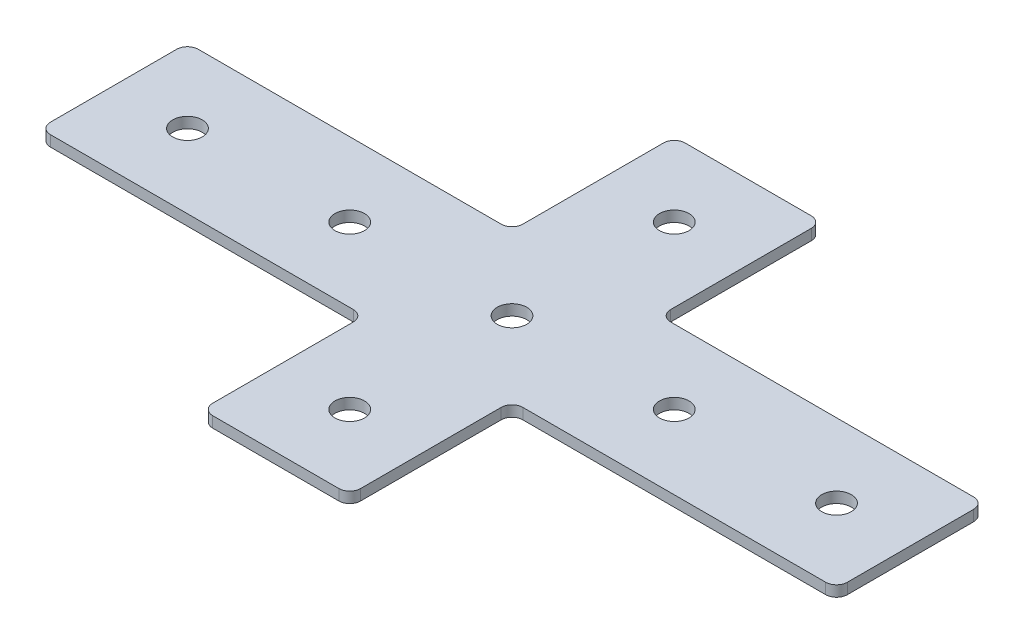
ISO-10303-21;
HEADER;
FILE_DESCRIPTION(('STEP AP214'),'2;1');
FILE_NAME('part.step','',(''),(''),'','','');
FILE_SCHEMA(('AUTOMOTIVE_DESIGN { 1 0 10303 214 1 1 1 1 }'));
ENDSEC;
DATA;
#1=APPLICATION_CONTEXT('core data for automotive mechanical design processes');
#2=APPLICATION_PROTOCOL_DEFINITION('international standard','automotive_design',2000,#1);
#3=PRODUCT_CONTEXT('',#1,'mechanical');
#4=PRODUCT('Part','Part','',(#3));
#5=PRODUCT_RELATED_PRODUCT_CATEGORY('part','',(#4));
#6=PRODUCT_DEFINITION_FORMATION('','',#4);
#7=PRODUCT_DEFINITION_CONTEXT('part definition',#1,'design');
#8=PRODUCT_DEFINITION('design','',#6,#7);
#9=PRODUCT_DEFINITION_SHAPE('','',#8);
#10=(LENGTH_UNIT() NAMED_UNIT(*) SI_UNIT(.MILLI.,.METRE.));
#11=(NAMED_UNIT(*) PLANE_ANGLE_UNIT() SI_UNIT($,.RADIAN.));
#12=(NAMED_UNIT(*) SI_UNIT($,.STERADIAN.) SOLID_ANGLE_UNIT());
#13=UNCERTAINTY_MEASURE_WITH_UNIT(LENGTH_MEASURE(1.E-05),#10,'distance_accuracy_value','');
#14=(GEOMETRIC_REPRESENTATION_CONTEXT(3) GLOBAL_UNCERTAINTY_ASSIGNED_CONTEXT((#13)) GLOBAL_UNIT_ASSIGNED_CONTEXT((#10,
#11,#12)) REPRESENTATION_CONTEXT('',''));
#15=CARTESIAN_POINT('',(0.,0.,0.));
#16=DIRECTION('',(0.,0.,1.));
#17=DIRECTION('',(1.,0.,0.));
#18=AXIS2_PLACEMENT_3D('',#15,#16,#17);
#19=CARTESIAN_POINT('',(-1.42451364331464,0.774709326684388,-0.849826009471144));
#20=DIRECTION('',(0.,-1.,0.));
#21=DIRECTION('',(0.,0.,-1.));
#22=AXIS2_PLACEMENT_3D('',#19,#20,#21);
#23=PLANE('',#22);
#24=CARTESIAN_POINT('',(-46.4245136433146,0.774709326684388,-0.849826009471123));
#25=DIRECTION('',(0.,-1.,0.));
#26=DIRECTION('',(0.,0.,1.));
#27=AXIS2_PLACEMENT_3D('',#24,#25,#26);
#28=CIRCLE('',#27,4.1);
#29=CARTESIAN_POINT('',(-46.4245136433146,0.774709326684388,3.25017399052888));
#30=VERTEX_POINT('',#29);
#31=EDGE_CURVE('E188',#30,#30,#28,.T.);
#32=ORIENTED_EDGE('',*,*,#31,.F.);
#33=EDGE_LOOP('',(#32));
#34=FACE_BOUND('',#33,.T.);
#35=CARTESIAN_POINT('',(-91.4245136433146,0.774709326684388,-0.849826009471122));
#36=DIRECTION('',(0.,-1.,0.));
#37=DIRECTION('',(0.,0.,1.));
#38=AXIS2_PLACEMENT_3D('',#35,#36,#37);
#39=CIRCLE('',#38,4.09999999999999);
#40=CARTESIAN_POINT('',(-91.4245136433146,0.774709326684388,3.25017399052886));
#41=VERTEX_POINT('',#40);
#42=EDGE_CURVE('E289',#41,#41,#39,.T.);
#43=ORIENTED_EDGE('',*,*,#42,.F.);
#44=EDGE_LOOP('',(#43));
#45=FACE_BOUND('',#44,.T.);
#46=CARTESIAN_POINT('',(-1.42451364331464,0.774709326684388,-0.849826009471144));
#47=DIRECTION('',(0.,1.,0.));
#48=DIRECTION('',(0.,0.,1.));
#49=AXIS2_PLACEMENT_3D('',#46,#47,#48);
#50=CIRCLE('',#49,4.1);
#51=CARTESIAN_POINT('',(-1.42451364331464,0.774709326684388,3.25017399052886));
#52=VERTEX_POINT('',#51);
#53=EDGE_CURVE('E360',#52,#52,#50,.T.);
#54=ORIENTED_EDGE('',*,*,#53,.T.);
#55=EDGE_LOOP('',(#54));
#56=FACE_BOUND('',#55,.T.);
#57=CARTESIAN_POINT('',(106.075486356685,0.774709326684388,-18.3498260094712));
#58=DIRECTION('',(0.,1.,0.));
#59=DIRECTION('',(0.,0.,1.));
#60=AXIS2_PLACEMENT_3D('',#57,#58,#59);
#61=CIRCLE('',#60,3.);
#62=CARTESIAN_POINT('',(109.075486356685,0.774709326684388,-18.3498260094712));
#63=VERTEX_POINT('',#62);
#64=CARTESIAN_POINT('',(106.075486356685,0.774709326684388,-21.3498260094712));
#65=VERTEX_POINT('',#64);
#66=EDGE_CURVE('E265',#63,#65,#61,.T.);
#67=ORIENTED_EDGE('',*,*,#66,.F.);
#68=DIRECTION('',(0.,0.,-1.));
#69=VECTOR('',#68,1.);
#70=CARTESIAN_POINT('',(109.075486356685,0.774709326684388,19.6501739905289));
#71=LINE('',#70,#69);
#72=CARTESIAN_POINT('',(109.075486356685,0.774709326684388,16.6501739905289));
#73=VERTEX_POINT('',#72);
#74=EDGE_CURVE('E366',#73,#63,#71,.T.);
#75=ORIENTED_EDGE('',*,*,#74,.F.);
#76=CARTESIAN_POINT('',(106.075486356685,0.774709326684388,16.6501739905289));
#77=DIRECTION('',(0.,-1.,0.));
#78=DIRECTION('',(0.,0.,-1.));
#79=AXIS2_PLACEMENT_3D('',#76,#77,#78);
#80=CIRCLE('',#79,3.);
#81=CARTESIAN_POINT('',(106.075486356685,0.774709326684388,19.6501739905289));
#82=VERTEX_POINT('',#81);
#83=EDGE_CURVE('E391',#73,#82,#80,.T.);
#84=ORIENTED_EDGE('',*,*,#83,.T.);
#85=DIRECTION('',(1.,0.,0.));
#86=VECTOR('',#85,1.);
#87=CARTESIAN_POINT('',(19.0754863566853,0.774709326684388,19.6501739905289));
#88=LINE('',#87,#86);
#89=CARTESIAN_POINT('',(22.0754863566853,0.774709326684388,19.6501739905289));
#90=VERTEX_POINT('',#89);
#91=EDGE_CURVE('E373',#90,#82,#88,.T.);
#92=ORIENTED_EDGE('',*,*,#91,.F.);
#93=CARTESIAN_POINT('',(22.0754863566853,0.774709326684388,22.6501739905289));
#94=DIRECTION('',(0.,-1.,0.));
#95=DIRECTION('',(0.,0.,-1.));
#96=AXIS2_PLACEMENT_3D('',#93,#94,#95);
#97=CIRCLE('',#96,3.);
#98=CARTESIAN_POINT('',(19.0754863566853,0.774709326684388,22.6501739905289));
#99=VERTEX_POINT('',#98);
#100=EDGE_CURVE('E10',#90,#99,#97,.F.);
#101=ORIENTED_EDGE('',*,*,#100,.T.);
#102=DIRECTION('',(0.,0.,-1.));
#103=VECTOR('',#102,1.);
#104=CARTESIAN_POINT('',(19.0754863566853,0.774709326684388,64.6501739905288));
#105=LINE('',#104,#103);
#106=CARTESIAN_POINT('',(19.0754863566853,0.774709326684388,61.6501739905288));
#107=VERTEX_POINT('',#106);
#108=EDGE_CURVE('E371',#107,#99,#105,.T.);
#109=ORIENTED_EDGE('',*,*,#108,.F.);
#110=CARTESIAN_POINT('',(16.0754863566853,0.774709326684388,61.6501739905288));
#111=DIRECTION('',(0.,-1.,0.));
#112=DIRECTION('',(0.,0.,-1.));
#113=AXIS2_PLACEMENT_3D('',#110,#111,#112);
#114=CIRCLE('',#113,3.);
#115=CARTESIAN_POINT('',(16.0754863566853,0.774709326684388,64.6501739905288));
#116=VERTEX_POINT('',#115);
#117=EDGE_CURVE('E393',#107,#116,#114,.T.);
#118=ORIENTED_EDGE('',*,*,#117,.T.);
#119=DIRECTION('',(1.,0.,0.));
#120=VECTOR('',#119,1.);
#121=CARTESIAN_POINT('',(-21.9245136433146,0.774709326684388,64.6501739905288));
#122=LINE('',#121,#120);
#123=CARTESIAN_POINT('',(-18.9245136433146,0.774709326684388,64.6501739905288));
#124=VERTEX_POINT('',#123);
#125=EDGE_CURVE('E368',#124,#116,#122,.T.);
#126=ORIENTED_EDGE('',*,*,#125,.F.);
#127=CARTESIAN_POINT('',(-18.9245136433146,0.774709326684388,61.6501739905288));
#128=DIRECTION('',(0.,1.,0.));
#129=DIRECTION('',(0.,0.,-1.));
#130=AXIS2_PLACEMENT_3D('',#127,#128,#129);
#131=CIRCLE('',#130,3.);
#132=CARTESIAN_POINT('',(-21.9245136433146,0.774709326684388,61.6501739905288));
#133=VERTEX_POINT('',#132);
#134=EDGE_CURVE('E322',#133,#124,#131,.T.);
#135=ORIENTED_EDGE('',*,*,#134,.F.);
#136=DIRECTION('',(0.,0.,-1.));
#137=VECTOR('',#136,1.);
#138=CARTESIAN_POINT('',(-21.9245136433146,0.774709326684388,64.6501739905288));
#139=LINE('',#138,#137);
#140=CARTESIAN_POINT('',(-21.9245136433146,0.774709326684388,22.6501739905289));
#141=VERTEX_POINT('',#140);
#142=EDGE_CURVE('E301',#133,#141,#139,.T.);
#143=ORIENTED_EDGE('',*,*,#142,.T.);
#144=CARTESIAN_POINT('',(-24.9245136433146,0.774709326684388,22.6501739905289));
#145=DIRECTION('',(0.,1.,0.));
#146=DIRECTION('',(0.,0.,-1.));
#147=AXIS2_PLACEMENT_3D('',#144,#145,#146);
#148=CIRCLE('',#147,3.);
#149=CARTESIAN_POINT('',(-24.9245136433146,0.774709326684388,19.6501739905289));
#150=VERTEX_POINT('',#149);
#151=EDGE_CURVE('E338',#150,#141,#148,.F.);
#152=ORIENTED_EDGE('',*,*,#151,.F.);
#153=DIRECTION('',(-1.,0.,0.));
#154=VECTOR('',#153,1.);
#155=CARTESIAN_POINT('',(-21.9245136433146,0.774709326684388,19.6501739905289));
#156=LINE('',#155,#154);
#157=CARTESIAN_POINT('',(-108.924513643315,0.774709326684388,19.6501739905289));
#158=VERTEX_POINT('',#157);
#159=EDGE_CURVE('E305',#150,#158,#156,.T.);
#160=ORIENTED_EDGE('',*,*,#159,.T.);
#161=CARTESIAN_POINT('',(-108.924513643315,0.774709326684388,16.6501739905289));
#162=DIRECTION('',(0.,1.,0.));
#163=DIRECTION('',(0.,0.,-1.));
#164=AXIS2_PLACEMENT_3D('',#161,#162,#163);
#165=CIRCLE('',#164,3.);
#166=CARTESIAN_POINT('',(-111.924513643315,0.774709326684388,16.6501739905289));
#167=VERTEX_POINT('',#166);
#168=EDGE_CURVE('E319',#167,#158,#165,.T.);
#169=ORIENTED_EDGE('',*,*,#168,.F.);
#170=DIRECTION('',(0.,0.,-1.));
#171=VECTOR('',#170,1.);
#172=CARTESIAN_POINT('',(-111.924513643315,0.774709326684388,19.6501739905289));
#173=LINE('',#172,#171);
#174=CARTESIAN_POINT('',(-111.924513643315,0.774709326684388,-18.3498260094712));
#175=VERTEX_POINT('',#174);
#176=EDGE_CURVE('E299',#167,#175,#173,.T.);
#177=ORIENTED_EDGE('',*,*,#176,.T.);
#178=CARTESIAN_POINT('',(-108.924513643315,0.774709326684388,-18.3498260094712));
#179=DIRECTION('',(0.,-1.,0.));
#180=DIRECTION('',(0.,0.,1.));
#181=AXIS2_PLACEMENT_3D('',#178,#179,#180);
#182=CIRCLE('',#181,3.);
#183=CARTESIAN_POINT('',(-108.924513643315,0.774709326684388,-21.3498260094712));
#184=VERTEX_POINT('',#183);
#185=EDGE_CURVE('E196',#175,#184,#182,.T.);
#186=ORIENTED_EDGE('',*,*,#185,.T.);
#187=DIRECTION('',(-1.,0.,0.));
#188=VECTOR('',#187,1.);
#189=CARTESIAN_POINT('',(-21.9245136433146,0.774709326684388,-21.3498260094712));
#190=LINE('',#189,#188);
#191=CARTESIAN_POINT('',(-24.9245136433146,0.774709326684388,-21.3498260094712));
#192=VERTEX_POINT('',#191);
#193=EDGE_CURVE('E206',#192,#184,#190,.T.);
#194=ORIENTED_EDGE('',*,*,#193,.F.);
#195=CARTESIAN_POINT('',(-24.9245136433146,0.774709326684388,-24.3498260094712));
#196=DIRECTION('',(0.,-1.,0.));
#197=DIRECTION('',(0.,0.,1.));
#198=AXIS2_PLACEMENT_3D('',#195,#196,#197);
#199=CIRCLE('',#198,3.);
#200=CARTESIAN_POINT('',(-21.9245136433146,0.774709326684388,-24.3498260094712));
#201=VERTEX_POINT('',#200);
#202=EDGE_CURVE('E230',#192,#201,#199,.F.);
#203=ORIENTED_EDGE('',*,*,#202,.T.);
#204=DIRECTION('',(0.,0.,1.));
#205=VECTOR('',#204,1.);
#206=CARTESIAN_POINT('',(-21.9245136433146,0.774709326684388,-66.3498260094711));
#207=LINE('',#206,#205);
#208=CARTESIAN_POINT('',(-21.9245136433146,0.774709326684388,-63.3498260094711));
#209=VERTEX_POINT('',#208);
#210=EDGE_CURVE('E212',#209,#201,#207,.T.);
#211=ORIENTED_EDGE('',*,*,#210,.F.);
#212=CARTESIAN_POINT('',(-18.9245136433146,0.774709326684388,-63.3498260094711));
#213=DIRECTION('',(0.,-1.,0.));
#214=DIRECTION('',(0.,0.,1.));
#215=AXIS2_PLACEMENT_3D('',#212,#213,#214);
#216=CIRCLE('',#215,3.);
#217=CARTESIAN_POINT('',(-18.9245136433146,0.774709326684388,-66.3498260094711));
#218=VERTEX_POINT('',#217);
#219=EDGE_CURVE('E219',#209,#218,#216,.T.);
#220=ORIENTED_EDGE('',*,*,#219,.T.);
#221=DIRECTION('',(1.,0.,0.));
#222=VECTOR('',#221,1.);
#223=CARTESIAN_POINT('',(-21.9245136433146,0.774709326684388,-66.3498260094711));
#224=LINE('',#223,#222);
#225=CARTESIAN_POINT('',(16.0754863566853,0.774709326684388,-66.3498260094711));
#226=VERTEX_POINT('',#225);
#227=EDGE_CURVE('E240',#218,#226,#224,.T.);
#228=ORIENTED_EDGE('',*,*,#227,.T.);
#229=CARTESIAN_POINT('',(16.0754863566853,0.774709326684388,-63.3498260094711));
#230=DIRECTION('',(0.,1.,0.));
#231=DIRECTION('',(0.,0.,1.));
#232=AXIS2_PLACEMENT_3D('',#229,#230,#231);
#233=CIRCLE('',#232,3.);
#234=CARTESIAN_POINT('',(19.0754863566853,0.774709326684388,-63.3498260094711));
#235=VERTEX_POINT('',#234);
#236=EDGE_CURVE('E268',#235,#226,#233,.T.);
#237=ORIENTED_EDGE('',*,*,#236,.F.);
#238=DIRECTION('',(0.,0.,1.));
#239=VECTOR('',#238,1.);
#240=CARTESIAN_POINT('',(19.0754863566853,0.774709326684388,-66.3498260094711));
#241=LINE('',#240,#239);
#242=CARTESIAN_POINT('',(19.0754863566853,0.774709326684388,-24.3498260094712));
#243=VERTEX_POINT('',#242);
#244=EDGE_CURVE('E243',#235,#243,#241,.T.);
#245=ORIENTED_EDGE('',*,*,#244,.T.);
#246=CARTESIAN_POINT('',(22.0754863566853,0.774709326684388,-24.3498260094712));
#247=DIRECTION('',(0.,1.,0.));
#248=DIRECTION('',(0.,0.,1.));
#249=AXIS2_PLACEMENT_3D('',#246,#247,#248);
#250=CIRCLE('',#249,3.);
#251=CARTESIAN_POINT('',(22.0754863566853,0.774709326684388,-21.3498260094712));
#252=VERTEX_POINT('',#251);
#253=EDGE_CURVE('E285',#252,#243,#250,.F.);
#254=ORIENTED_EDGE('',*,*,#253,.F.);
#255=DIRECTION('',(1.,0.,0.));
#256=VECTOR('',#255,1.);
#257=CARTESIAN_POINT('',(19.0754863566853,0.774709326684388,-21.3498260094712));
#258=LINE('',#257,#256);
#259=EDGE_CURVE('E247',#252,#65,#258,.T.);
#260=ORIENTED_EDGE('',*,*,#259,.T.);
#261=EDGE_LOOP('',(#67,#75,#84,#92,#101,#109,#118,#126,#135,#143,#152,#160,#169,#177,#186,#194,
#203,#211,#220,#228,#237,#245,#254,#260));
#262=FACE_BOUND('',#261,.T.);
#263=CARTESIAN_POINT('',(88.5754863566854,0.774709326684388,-0.849826009471144));
#264=DIRECTION('',(0.,1.,0.));
#265=DIRECTION('',(0.,0.,1.));
#266=AXIS2_PLACEMENT_3D('',#263,#264,#265);
#267=CIRCLE('',#266,4.09999999999999);
#268=CARTESIAN_POINT('',(88.5754863566854,0.774709326684388,3.25017399052884));
#269=VERTEX_POINT('',#268);
#270=EDGE_CURVE('E342',#269,#269,#267,.T.);
#271=ORIENTED_EDGE('',*,*,#270,.T.);
#272=EDGE_LOOP('',(#271));
#273=FACE_BOUND('',#272,.T.);
#274=CARTESIAN_POINT('',(-1.42451364331465,0.774709326684388,44.1501739905289));
#275=DIRECTION('',(0.,1.,0.));
#276=DIRECTION('',(0.,0.,1.));
#277=AXIS2_PLACEMENT_3D('',#274,#275,#276);
#278=CIRCLE('',#277,4.1);
#279=CARTESIAN_POINT('',(-1.42451364331465,0.774709326684388,48.2501739905289));
#280=VERTEX_POINT('',#279);
#281=EDGE_CURVE('E348',#280,#280,#278,.T.);
#282=ORIENTED_EDGE('',*,*,#281,.T.);
#283=EDGE_LOOP('',(#282));
#284=FACE_BOUND('',#283,.T.);
#285=CARTESIAN_POINT('',(43.5754863566854,0.774709326684388,-0.849826009471134));
#286=DIRECTION('',(0.,1.,0.));
#287=DIRECTION('',(0.,0.,1.));
#288=AXIS2_PLACEMENT_3D('',#285,#286,#287);
#289=CIRCLE('',#288,4.1);
#290=CARTESIAN_POINT('',(43.5754863566854,0.774709326684388,3.25017399052887));
#291=VERTEX_POINT('',#290);
#292=EDGE_CURVE('E354',#291,#291,#289,.T.);
#293=ORIENTED_EDGE('',*,*,#292,.T.);
#294=EDGE_LOOP('',(#293));
#295=FACE_BOUND('',#294,.T.);
#296=CARTESIAN_POINT('',(-1.42451364331465,0.774709326684388,-45.8498260094711));
#297=DIRECTION('',(0.,-1.,0.));
#298=DIRECTION('',(0.,0.,-1.));
#299=AXIS2_PLACEMENT_3D('',#296,#297,#298);
#300=CIRCLE('',#299,4.1);
#301=CARTESIAN_POINT('',(-1.42451364331465,0.774709326684388,-49.9498260094711));
#302=VERTEX_POINT('',#301);
#303=EDGE_CURVE('E234',#302,#302,#300,.T.);
#304=ORIENTED_EDGE('',*,*,#303,.F.);
#305=EDGE_LOOP('',(#304));
#306=FACE_BOUND('',#305,.T.);
#307=ADVANCED_FACE('F16',(#34,#45,#56,#262,#273,#284,#295,#306),#23,.T.);
#308=CARTESIAN_POINT('',(109.075486356685,0.774709326684388,19.6501739905289));
#309=DIRECTION('',(1.,0.,0.));
#310=DIRECTION('',(0.,0.,-1.));
#311=AXIS2_PLACEMENT_3D('',#308,#309,#310);
#312=PLANE('',#311);
#313=ORIENTED_EDGE('',*,*,#74,.T.);
#314=DIRECTION('',(0.,1.,0.));
#315=VECTOR('',#314,1.);
#316=CARTESIAN_POINT('',(109.075486356685,0.774709326684388,-18.3498260094712));
#317=LINE('',#316,#315);
#318=CARTESIAN_POINT('',(109.075486356685,3.77470932668439,-18.3498260094712));
#319=VERTEX_POINT('',#318);
#320=EDGE_CURVE('E279',#319,#63,#317,.F.);
#321=ORIENTED_EDGE('',*,*,#320,.F.);
#322=DIRECTION('',(0.,0.,-1.));
#323=VECTOR('',#322,1.);
#324=CARTESIAN_POINT('',(109.075486356685,3.77470932668439,19.6501739905289));
#325=LINE('',#324,#323);
#326=CARTESIAN_POINT('',(109.075486356685,3.77470932668439,16.6501739905289));
#327=VERTEX_POINT('',#326);
#328=EDGE_CURVE('E363',#327,#319,#325,.T.);
#329=ORIENTED_EDGE('',*,*,#328,.F.);
#330=DIRECTION('',(0.,1.,0.));
#331=VECTOR('',#330,1.);
#332=CARTESIAN_POINT('',(109.075486356685,0.774709326684388,16.6501739905289));
#333=LINE('',#332,#331);
#334=EDGE_CURVE('E405',#327,#73,#333,.F.);
#335=ORIENTED_EDGE('',*,*,#334,.T.);
#336=EDGE_LOOP('',(#313,#321,#329,#335));
#337=FACE_BOUND('',#336,.T.);
#338=ADVANCED_FACE('F494',(#337),#312,.T.);
#339=CARTESIAN_POINT('',(-1.42451364331464,3.77470932668439,-0.849826009471144));
#340=DIRECTION('',(0.,-1.,0.));
#341=DIRECTION('',(0.,0.,-1.));
#342=AXIS2_PLACEMENT_3D('',#339,#340,#341);
#343=PLANE('',#342);
#344=CARTESIAN_POINT('',(-46.4245136433146,3.77470932668439,-0.849826009471123));
#345=DIRECTION('',(0.,-1.,0.));
#346=DIRECTION('',(0.,0.,1.));
#347=AXIS2_PLACEMENT_3D('',#344,#345,#346);
#348=CIRCLE('',#347,4.1);
#349=CARTESIAN_POINT('',(-46.4245136433146,3.77470932668439,3.25017399052888));
#350=VERTEX_POINT('',#349);
#351=EDGE_CURVE('E292',#350,#350,#348,.T.);
#352=ORIENTED_EDGE('',*,*,#351,.T.);
#353=EDGE_LOOP('',(#352));
#354=FACE_BOUND('',#353,.T.);
#355=CARTESIAN_POINT('',(-91.4245136433146,3.77470932668439,-0.849826009471122));
#356=DIRECTION('',(0.,-1.,0.));
#357=DIRECTION('',(0.,0.,1.));
#358=AXIS2_PLACEMENT_3D('',#355,#356,#357);
#359=CIRCLE('',#358,4.09999999999999);
#360=CARTESIAN_POINT('',(-91.4245136433146,3.77470932668439,3.25017399052886));
#361=VERTEX_POINT('',#360);
#362=EDGE_CURVE('E288',#361,#361,#359,.T.);
#363=ORIENTED_EDGE('',*,*,#362,.T.);
#364=EDGE_LOOP('',(#363));
#365=FACE_BOUND('',#364,.T.);
#366=CARTESIAN_POINT('',(-1.42451364331464,3.77470932668439,-0.849826009471144));
#367=DIRECTION('',(0.,1.,0.));
#368=DIRECTION('',(0.,0.,1.));
#369=AXIS2_PLACEMENT_3D('',#366,#367,#368);
#370=CIRCLE('',#369,4.1);
#371=CARTESIAN_POINT('',(-1.42451364331464,3.77470932668439,3.25017399052886));
#372=VERTEX_POINT('',#371);
#373=EDGE_CURVE('E357',#372,#372,#370,.T.);
#374=ORIENTED_EDGE('',*,*,#373,.F.);
#375=EDGE_LOOP('',(#374));
#376=FACE_BOUND('',#375,.T.);
#377=ORIENTED_EDGE('',*,*,#328,.T.);
#378=CARTESIAN_POINT('',(106.075486356685,3.77470932668439,-18.3498260094712));
#379=DIRECTION('',(0.,1.,0.));
#380=DIRECTION('',(0.,0.,1.));
#381=AXIS2_PLACEMENT_3D('',#378,#379,#380);
#382=CIRCLE('',#381,3.);
#383=CARTESIAN_POINT('',(106.075486356685,3.77470932668439,-21.3498260094712));
#384=VERTEX_POINT('',#383);
#385=EDGE_CURVE('E250',#384,#319,#382,.F.);
#386=ORIENTED_EDGE('',*,*,#385,.F.);
#387=DIRECTION('',(1.,0.,0.));
#388=VECTOR('',#387,1.);
#389=CARTESIAN_POINT('',(19.0754863566853,3.77470932668439,-21.3498260094712));
#390=LINE('',#389,#388);
#391=CARTESIAN_POINT('',(22.0754863566853,3.77470932668439,-21.3498260094712));
#392=VERTEX_POINT('',#391);
#393=EDGE_CURVE('E244',#392,#384,#390,.T.);
#394=ORIENTED_EDGE('',*,*,#393,.F.);
#395=CARTESIAN_POINT('',(22.0754863566853,3.77470932668439,-24.3498260094712));
#396=DIRECTION('',(0.,1.,0.));
#397=DIRECTION('',(0.,0.,1.));
#398=AXIS2_PLACEMENT_3D('',#395,#396,#397);
#399=CIRCLE('',#398,3.);
#400=CARTESIAN_POINT('',(19.0754863566853,3.77470932668439,-24.3498260094712));
#401=VERTEX_POINT('',#400);
#402=EDGE_CURVE('E282',#401,#392,#399,.T.);
#403=ORIENTED_EDGE('',*,*,#402,.F.);
#404=DIRECTION('',(0.,0.,1.));
#405=VECTOR('',#404,1.);
#406=CARTESIAN_POINT('',(19.0754863566853,3.77470932668439,-66.3498260094711));
#407=LINE('',#406,#405);
#408=CARTESIAN_POINT('',(19.0754863566853,3.77470932668439,-63.3498260094711));
#409=VERTEX_POINT('',#408);
#410=EDGE_CURVE('E253',#409,#401,#407,.T.);
#411=ORIENTED_EDGE('',*,*,#410,.F.);
#412=CARTESIAN_POINT('',(16.0754863566853,3.77470932668439,-63.3498260094711));
#413=DIRECTION('',(0.,1.,0.));
#414=DIRECTION('',(0.,0.,1.));
#415=AXIS2_PLACEMENT_3D('',#412,#413,#414);
#416=CIRCLE('',#415,3.);
#417=CARTESIAN_POINT('',(16.0754863566853,3.77470932668439,-66.3498260094711));
#418=VERTEX_POINT('',#417);
#419=EDGE_CURVE('E260',#418,#409,#416,.F.);
#420=ORIENTED_EDGE('',*,*,#419,.F.);
#421=DIRECTION('',(1.,0.,0.));
#422=VECTOR('',#421,1.);
#423=CARTESIAN_POINT('',(-21.9245136433146,3.77470932668439,-66.3498260094711));
#424=LINE('',#423,#422);
#425=CARTESIAN_POINT('',(-18.9245136433146,3.77470932668439,-66.3498260094711));
#426=VERTEX_POINT('',#425);
#427=EDGE_CURVE('E237',#426,#418,#424,.T.);
#428=ORIENTED_EDGE('',*,*,#427,.F.);
#429=CARTESIAN_POINT('',(-18.9245136433146,3.77470932668439,-63.3498260094711));
#430=DIRECTION('',(0.,-1.,0.));
#431=DIRECTION('',(0.,0.,1.));
#432=AXIS2_PLACEMENT_3D('',#429,#430,#431);
#433=CIRCLE('',#432,3.);
#434=CARTESIAN_POINT('',(-21.9245136433146,3.77470932668439,-63.3498260094711));
#435=VERTEX_POINT('',#434);
#436=EDGE_CURVE('E205',#426,#435,#433,.F.);
#437=ORIENTED_EDGE('',*,*,#436,.T.);
#438=DIRECTION('',(0.,0.,1.));
#439=VECTOR('',#438,1.);
#440=CARTESIAN_POINT('',(-21.9245136433146,3.77470932668439,-66.3498260094711));
#441=LINE('',#440,#439);
#442=CARTESIAN_POINT('',(-21.9245136433146,3.77470932668439,-24.3498260094712));
#443=VERTEX_POINT('',#442);
#444=EDGE_CURVE('E460',#435,#443,#441,.T.);
#445=ORIENTED_EDGE('',*,*,#444,.T.);
#446=CARTESIAN_POINT('',(-24.9245136433146,3.77470932668439,-24.3498260094712));
#447=DIRECTION('',(0.,-1.,0.));
#448=DIRECTION('',(0.,0.,1.));
#449=AXIS2_PLACEMENT_3D('',#446,#447,#448);
#450=CIRCLE('',#449,3.);
#451=CARTESIAN_POINT('',(-24.9245136433146,3.77470932668439,-21.3498260094712));
#452=VERTEX_POINT('',#451);
#453=EDGE_CURVE('E197',#443,#452,#450,.T.);
#454=ORIENTED_EDGE('',*,*,#453,.T.);
#455=DIRECTION('',(-1.,0.,0.));
#456=VECTOR('',#455,1.);
#457=CARTESIAN_POINT('',(-21.9245136433146,3.77470932668439,-21.3498260094712));
#458=LINE('',#457,#456);
#459=CARTESIAN_POINT('',(-108.924513643315,3.77470932668439,-21.3498260094712));
#460=VERTEX_POINT('',#459);
#461=EDGE_CURVE('E204',#452,#460,#458,.T.);
#462=ORIENTED_EDGE('',*,*,#461,.T.);
#463=CARTESIAN_POINT('',(-108.924513643315,3.77470932668439,-18.3498260094712));
#464=DIRECTION('',(0.,-1.,0.));
#465=DIRECTION('',(0.,0.,1.));
#466=AXIS2_PLACEMENT_3D('',#463,#464,#465);
#467=CIRCLE('',#466,3.);
#468=CARTESIAN_POINT('',(-111.924513643315,3.77470932668439,-18.3498260094712));
#469=VERTEX_POINT('',#468);
#470=EDGE_CURVE('E193',#460,#469,#467,.F.);
#471=ORIENTED_EDGE('',*,*,#470,.T.);
#472=DIRECTION('',(0.,0.,-1.));
#473=VECTOR('',#472,1.);
#474=CARTESIAN_POINT('',(-111.924513643315,3.77470932668439,19.6501739905289));
#475=LINE('',#474,#473);
#476=CARTESIAN_POINT('',(-111.924513643315,3.77470932668439,16.6501739905289));
#477=VERTEX_POINT('',#476);
#478=EDGE_CURVE('E178',#477,#469,#475,.T.);
#479=ORIENTED_EDGE('',*,*,#478,.F.);
#480=CARTESIAN_POINT('',(-108.924513643315,3.77470932668439,16.6501739905289));
#481=DIRECTION('',(0.,1.,0.));
#482=DIRECTION('',(0.,0.,-1.));
#483=AXIS2_PLACEMENT_3D('',#480,#481,#482);
#484=CIRCLE('',#483,3.);
#485=CARTESIAN_POINT('',(-108.924513643315,3.77470932668439,19.6501739905289));
#486=VERTEX_POINT('',#485);
#487=EDGE_CURVE('E307',#486,#477,#484,.F.);
#488=ORIENTED_EDGE('',*,*,#487,.F.);
#489=DIRECTION('',(-1.,0.,0.));
#490=VECTOR('',#489,1.);
#491=CARTESIAN_POINT('',(-21.9245136433146,3.77470932668439,19.6501739905289));
#492=LINE('',#491,#490);
#493=CARTESIAN_POINT('',(-24.9245136433146,3.77470932668439,19.6501739905289));
#494=VERTEX_POINT('',#493);
#495=EDGE_CURVE('E302',#494,#486,#492,.T.);
#496=ORIENTED_EDGE('',*,*,#495,.F.);
#497=CARTESIAN_POINT('',(-24.9245136433146,3.77470932668439,22.6501739905289));
#498=DIRECTION('',(0.,1.,0.));
#499=DIRECTION('',(0.,0.,-1.));
#500=AXIS2_PLACEMENT_3D('',#497,#498,#499);
#501=CIRCLE('',#500,3.);
#502=CARTESIAN_POINT('',(-21.9245136433146,3.77470932668439,22.6501739905289));
#503=VERTEX_POINT('',#502);
#504=EDGE_CURVE('E336',#503,#494,#501,.T.);
#505=ORIENTED_EDGE('',*,*,#504,.F.);
#506=DIRECTION('',(0.,0.,-1.));
#507=VECTOR('',#506,1.);
#508=CARTESIAN_POINT('',(-21.9245136433146,3.77470932668439,64.6501739905288));
#509=LINE('',#508,#507);
#510=CARTESIAN_POINT('',(-21.9245136433146,3.77470932668439,61.6501739905288));
#511=VERTEX_POINT('',#510);
#512=EDGE_CURVE('E187',#511,#503,#509,.T.);
#513=ORIENTED_EDGE('',*,*,#512,.F.);
#514=CARTESIAN_POINT('',(-18.9245136433146,3.77470932668439,61.6501739905288));
#515=DIRECTION('',(0.,1.,0.));
#516=DIRECTION('',(0.,0.,-1.));
#517=AXIS2_PLACEMENT_3D('',#514,#515,#516);
#518=CIRCLE('',#517,3.);
#519=CARTESIAN_POINT('',(-18.9245136433146,3.77470932668439,64.6501739905288));
#520=VERTEX_POINT('',#519);
#521=EDGE_CURVE('E314',#520,#511,#518,.F.);
#522=ORIENTED_EDGE('',*,*,#521,.F.);
#523=DIRECTION('',(1.,0.,0.));
#524=VECTOR('',#523,1.);
#525=CARTESIAN_POINT('',(-21.9245136433146,3.77470932668439,64.6501739905288));
#526=LINE('',#525,#524);
#527=CARTESIAN_POINT('',(16.0754863566853,3.77470932668439,64.6501739905288));
#528=VERTEX_POINT('',#527);
#529=EDGE_CURVE('E378',#520,#528,#526,.T.);
#530=ORIENTED_EDGE('',*,*,#529,.T.);
#531=CARTESIAN_POINT('',(16.0754863566853,3.77470932668439,61.6501739905288));
#532=DIRECTION('',(0.,-1.,0.));
#533=DIRECTION('',(0.,0.,-1.));
#534=AXIS2_PLACEMENT_3D('',#531,#532,#533);
#535=CIRCLE('',#534,3.);
#536=CARTESIAN_POINT('',(19.0754863566853,3.77470932668439,61.6501739905288));
#537=VERTEX_POINT('',#536);
#538=EDGE_CURVE('E386',#528,#537,#535,.F.);
#539=ORIENTED_EDGE('',*,*,#538,.T.);
#540=DIRECTION('',(0.,0.,-1.));
#541=VECTOR('',#540,1.);
#542=CARTESIAN_POINT('',(19.0754863566853,3.77470932668439,64.6501739905288));
#543=LINE('',#542,#541);
#544=CARTESIAN_POINT('',(19.0754863566853,3.77470932668439,22.6501739905289));
#545=VERTEX_POINT('',#544);
#546=EDGE_CURVE('E380',#537,#545,#543,.T.);
#547=ORIENTED_EDGE('',*,*,#546,.T.);
#548=CARTESIAN_POINT('',(22.0754863566853,3.77470932668439,22.6501739905289));
#549=DIRECTION('',(0.,-1.,0.));
#550=DIRECTION('',(0.,0.,-1.));
#551=AXIS2_PLACEMENT_3D('',#548,#549,#550);
#552=CIRCLE('',#551,3.);
#553=CARTESIAN_POINT('',(22.0754863566853,3.77470932668439,19.6501739905289));
#554=VERTEX_POINT('',#553);
#555=EDGE_CURVE('E24',#545,#554,#552,.T.);
#556=ORIENTED_EDGE('',*,*,#555,.T.);
#557=DIRECTION('',(1.,0.,0.));
#558=VECTOR('',#557,1.);
#559=CARTESIAN_POINT('',(19.0754863566853,3.77470932668439,19.6501739905289));
#560=LINE('',#559,#558);
#561=CARTESIAN_POINT('',(106.075486356685,3.77470932668439,19.6501739905289));
#562=VERTEX_POINT('',#561);
#563=EDGE_CURVE('E369',#554,#562,#560,.T.);
#564=ORIENTED_EDGE('',*,*,#563,.T.);
#565=CARTESIAN_POINT('',(106.075486356685,3.77470932668439,16.6501739905289));
#566=DIRECTION('',(0.,-1.,0.));
#567=DIRECTION('',(0.,0.,-1.));
#568=AXIS2_PLACEMENT_3D('',#565,#566,#567);
#569=CIRCLE('',#568,3.);
#570=EDGE_CURVE('E376',#562,#327,#569,.F.);
#571=ORIENTED_EDGE('',*,*,#570,.T.);
#572=EDGE_LOOP('',(#377,#386,#394,#403,#411,#420,#428,#437,#445,#454,#462,#471,#479,#488,#496,
#505,#513,#522,#530,#539,#547,#556,#564,#571));
#573=FACE_BOUND('',#572,.T.);
#574=CARTESIAN_POINT('',(88.5754863566854,3.77470932668439,-0.849826009471144));
#575=DIRECTION('',(0.,1.,0.));
#576=DIRECTION('',(0.,0.,1.));
#577=AXIS2_PLACEMENT_3D('',#574,#575,#576);
#578=CIRCLE('',#577,4.09999999999999);
#579=CARTESIAN_POINT('',(88.5754863566854,3.77470932668439,3.25017399052884));
#580=VERTEX_POINT('',#579);
#581=EDGE_CURVE('E341',#580,#580,#578,.T.);
#582=ORIENTED_EDGE('',*,*,#581,.F.);
#583=EDGE_LOOP('',(#582));
#584=FACE_BOUND('',#583,.T.);
#585=CARTESIAN_POINT('',(-1.42451364331465,3.77470932668439,44.1501739905289));
#586=DIRECTION('',(0.,1.,0.));
#587=DIRECTION('',(0.,0.,1.));
#588=AXIS2_PLACEMENT_3D('',#585,#586,#587);
#589=CIRCLE('',#588,4.1);
#590=CARTESIAN_POINT('',(-1.42451364331465,3.77470932668439,48.2501739905289));
#591=VERTEX_POINT('',#590);
#592=EDGE_CURVE('E345',#591,#591,#589,.T.);
#593=ORIENTED_EDGE('',*,*,#592,.F.);
#594=EDGE_LOOP('',(#593));
#595=FACE_BOUND('',#594,.T.);
#596=CARTESIAN_POINT('',(43.5754863566854,3.77470932668439,-0.849826009471134));
#597=DIRECTION('',(0.,1.,0.));
#598=DIRECTION('',(0.,0.,1.));
#599=AXIS2_PLACEMENT_3D('',#596,#597,#598);
#600=CIRCLE('',#599,4.1);
#601=CARTESIAN_POINT('',(43.5754863566854,3.77470932668439,3.25017399052887));
#602=VERTEX_POINT('',#601);
#603=EDGE_CURVE('E351',#602,#602,#600,.T.);
#604=ORIENTED_EDGE('',*,*,#603,.F.);
#605=EDGE_LOOP('',(#604));
#606=FACE_BOUND('',#605,.T.);
#607=CARTESIAN_POINT('',(-1.42451364331465,3.77470932668439,-45.8498260094711));
#608=DIRECTION('',(0.,-1.,0.));
#609=DIRECTION('',(0.,0.,-1.));
#610=AXIS2_PLACEMENT_3D('',#607,#608,#609);
#611=CIRCLE('',#610,4.1);
#612=CARTESIAN_POINT('',(-1.42451364331465,3.77470932668439,-49.9498260094711));
#613=VERTEX_POINT('',#612);
#614=EDGE_CURVE('E233',#613,#613,#611,.T.);
#615=ORIENTED_EDGE('',*,*,#614,.T.);
#616=EDGE_LOOP('',(#615));
#617=FACE_BOUND('',#616,.T.);
#618=ADVANCED_FACE('F200',(#354,#365,#376,#573,#584,#595,#606,#617),#343,.F.);
#619=CARTESIAN_POINT('',(-1.42451364331464,0.774709326684388,-0.849826009471144));
#620=DIRECTION('',(0.,1.,0.));
#621=DIRECTION('',(0.,0.,1.));
#622=AXIS2_PLACEMENT_3D('',#619,#620,#621);
#623=CYLINDRICAL_SURFACE('',#622,4.1);
#624=ORIENTED_EDGE('',*,*,#53,.F.);
#625=EDGE_LOOP('',(#624));
#626=FACE_BOUND('',#625,.T.);
#627=ORIENTED_EDGE('',*,*,#373,.T.);
#628=EDGE_LOOP('',(#627));
#629=FACE_BOUND('',#628,.T.);
#630=ADVANCED_FACE('F502',(#626,#629),#623,.F.);
#631=CARTESIAN_POINT('',(43.5754863566854,0.774709326684388,-0.849826009471134));
#632=DIRECTION('',(0.,1.,0.));
#633=DIRECTION('',(0.,0.,1.));
#634=AXIS2_PLACEMENT_3D('',#631,#632,#633);
#635=CYLINDRICAL_SURFACE('',#634,4.1);
#636=ORIENTED_EDGE('',*,*,#603,.T.);
#637=EDGE_LOOP('',(#636));
#638=FACE_BOUND('',#637,.T.);
#639=ORIENTED_EDGE('',*,*,#292,.F.);
#640=EDGE_LOOP('',(#639));
#641=FACE_BOUND('',#640,.T.);
#642=ADVANCED_FACE('F530',(#638,#641),#635,.F.);
#643=CARTESIAN_POINT('',(88.5754863566854,0.774709326684388,-0.849826009471144));
#644=DIRECTION('',(0.,1.,0.));
#645=DIRECTION('',(0.,0.,1.));
#646=AXIS2_PLACEMENT_3D('',#643,#644,#645);
#647=CYLINDRICAL_SURFACE('',#646,4.09999999999999);
#648=ORIENTED_EDGE('',*,*,#581,.T.);
#649=EDGE_LOOP('',(#648));
#650=FACE_BOUND('',#649,.T.);
#651=ORIENTED_EDGE('',*,*,#270,.F.);
#652=EDGE_LOOP('',(#651));
#653=FACE_BOUND('',#652,.T.);
#654=ADVANCED_FACE('F528',(#650,#653),#647,.F.);
#655=CARTESIAN_POINT('',(-111.924513643315,0.774709326684388,19.6501739905289));
#656=DIRECTION('',(-1.,0.,0.));
#657=DIRECTION('',(0.,0.,-1.));
#658=AXIS2_PLACEMENT_3D('',#655,#656,#657);
#659=PLANE('',#658);
#660=ORIENTED_EDGE('',*,*,#478,.T.);
#661=DIRECTION('',(0.,1.,0.));
#662=VECTOR('',#661,1.);
#663=CARTESIAN_POINT('',(-111.924513643315,0.774709326684388,-18.3498260094712));
#664=LINE('',#663,#662);
#665=EDGE_CURVE('E182',#469,#175,#664,.F.);
#666=ORIENTED_EDGE('',*,*,#665,.T.);
#667=ORIENTED_EDGE('',*,*,#176,.F.);
#668=DIRECTION('',(0.,1.,0.));
#669=VECTOR('',#668,1.);
#670=CARTESIAN_POINT('',(-111.924513643315,0.774709326684388,16.6501739905289));
#671=LINE('',#670,#669);
#672=EDGE_CURVE('E184',#477,#167,#671,.F.);
#673=ORIENTED_EDGE('',*,*,#672,.F.);
#674=EDGE_LOOP('',(#660,#666,#667,#673));
#675=FACE_BOUND('',#674,.T.);
#676=ADVANCED_FACE('F180',(#675),#659,.T.);
#677=CARTESIAN_POINT('',(-46.4245136433146,0.774709326684388,-0.849826009471123));
#678=DIRECTION('',(0.,1.,0.));
#679=DIRECTION('',(0.,0.,1.));
#680=AXIS2_PLACEMENT_3D('',#677,#678,#679);
#681=CYLINDRICAL_SURFACE('',#680,4.1);
#682=ORIENTED_EDGE('',*,*,#31,.T.);
#683=EDGE_LOOP('',(#682));
#684=FACE_BOUND('',#683,.T.);
#685=ORIENTED_EDGE('',*,*,#351,.F.);
#686=EDGE_LOOP('',(#685));
#687=FACE_BOUND('',#686,.T.);
#688=ADVANCED_FACE('F710',(#684,#687),#681,.F.);
#689=CARTESIAN_POINT('',(-91.4245136433146,0.774709326684388,-0.849826009471122));
#690=DIRECTION('',(0.,1.,0.));
#691=DIRECTION('',(0.,0.,1.));
#692=AXIS2_PLACEMENT_3D('',#689,#690,#691);
#693=CYLINDRICAL_SURFACE('',#692,4.09999999999999);
#694=ORIENTED_EDGE('',*,*,#362,.F.);
#695=EDGE_LOOP('',(#694));
#696=FACE_BOUND('',#695,.T.);
#697=ORIENTED_EDGE('',*,*,#42,.T.);
#698=EDGE_LOOP('',(#697));
#699=FACE_BOUND('',#698,.T.);
#700=ADVANCED_FACE('F538',(#696,#699),#693,.F.);
#701=CARTESIAN_POINT('',(19.0754863566853,0.774709326684388,19.6501739905289));
#702=DIRECTION('',(0.,0.,1.));
#703=DIRECTION('',(1.,0.,0.));
#704=AXIS2_PLACEMENT_3D('',#701,#702,#703);
#705=PLANE('',#704);
#706=ORIENTED_EDGE('',*,*,#563,.F.);
#707=DIRECTION('',(0.,1.,0.));
#708=VECTOR('',#707,1.);
#709=CARTESIAN_POINT('',(22.0754863566853,0.774709326684388,19.6501739905289));
#710=LINE('',#709,#708);
#711=EDGE_CURVE('E403',#554,#90,#710,.F.);
#712=ORIENTED_EDGE('',*,*,#711,.T.);
#713=ORIENTED_EDGE('',*,*,#91,.T.);
#714=DIRECTION('',(0.,1.,0.));
#715=VECTOR('',#714,1.);
#716=CARTESIAN_POINT('',(106.075486356685,0.774709326684388,19.6501739905289));
#717=LINE('',#716,#715);
#718=EDGE_CURVE('E400',#82,#562,#717,.T.);
#719=ORIENTED_EDGE('',*,*,#718,.T.);
#720=EDGE_LOOP('',(#706,#712,#713,#719));
#721=FACE_BOUND('',#720,.T.);
#722=ADVANCED_FACE('F411',(#721),#705,.T.);
#723=CARTESIAN_POINT('',(19.0754863566853,0.774709326684388,64.6501739905288));
#724=DIRECTION('',(1.,0.,0.));
#725=DIRECTION('',(0.,0.,-1.));
#726=AXIS2_PLACEMENT_3D('',#723,#724,#725);
#727=PLANE('',#726);
#728=ORIENTED_EDGE('',*,*,#546,.F.);
#729=DIRECTION('',(0.,1.,0.));
#730=VECTOR('',#729,1.);
#731=CARTESIAN_POINT('',(19.0754863566853,0.774709326684388,61.6501739905288));
#732=LINE('',#731,#730);
#733=EDGE_CURVE('E36',#537,#107,#732,.F.);
#734=ORIENTED_EDGE('',*,*,#733,.T.);
#735=ORIENTED_EDGE('',*,*,#108,.T.);
#736=DIRECTION('',(0.,1.,0.));
#737=VECTOR('',#736,1.);
#738=CARTESIAN_POINT('',(19.0754863566853,3.77470932668439,22.6501739905289));
#739=LINE('',#738,#737);
#740=EDGE_CURVE('E396',#99,#545,#739,.T.);
#741=ORIENTED_EDGE('',*,*,#740,.T.);
#742=EDGE_LOOP('',(#728,#734,#735,#741));
#743=FACE_BOUND('',#742,.T.);
#744=ADVANCED_FACE('F414',(#743),#727,.T.);
#745=CARTESIAN_POINT('',(-21.9245136433146,0.774709326684388,64.6501739905288));
#746=DIRECTION('',(0.,0.,1.));
#747=DIRECTION('',(1.,0.,0.));
#748=AXIS2_PLACEMENT_3D('',#745,#746,#747);
#749=PLANE('',#748);
#750=ORIENTED_EDGE('',*,*,#529,.F.);
#751=DIRECTION('',(0.,1.,0.));
#752=VECTOR('',#751,1.);
#753=CARTESIAN_POINT('',(-18.9245136433146,0.774709326684388,64.6501739905288));
#754=LINE('',#753,#752);
#755=EDGE_CURVE('E316',#124,#520,#754,.T.);
#756=ORIENTED_EDGE('',*,*,#755,.F.);
#757=ORIENTED_EDGE('',*,*,#125,.T.);
#758=DIRECTION('',(0.,1.,0.));
#759=VECTOR('',#758,1.);
#760=CARTESIAN_POINT('',(16.0754863566853,0.774709326684388,64.6501739905288));
#761=LINE('',#760,#759);
#762=EDGE_CURVE('E388',#116,#528,#761,.T.);
#763=ORIENTED_EDGE('',*,*,#762,.T.);
#764=EDGE_LOOP('',(#750,#756,#757,#763));
#765=FACE_BOUND('',#764,.T.);
#766=ADVANCED_FACE('F423',(#765),#749,.T.);
#767=CARTESIAN_POINT('',(16.0754863566853,0.774709326684388,61.6501739905288));
#768=DIRECTION('',(0.,1.,0.));
#769=DIRECTION('',(0.,0.,1.));
#770=AXIS2_PLACEMENT_3D('',#767,#768,#769);
#771=CYLINDRICAL_SURFACE('',#770,3.);
#772=ORIENTED_EDGE('',*,*,#117,.F.);
#773=ORIENTED_EDGE('',*,*,#733,.F.);
#774=ORIENTED_EDGE('',*,*,#538,.F.);
#775=ORIENTED_EDGE('',*,*,#762,.F.);
#776=EDGE_LOOP('',(#772,#773,#774,#775));
#777=FACE_BOUND('',#776,.T.);
#778=ADVANCED_FACE('F420',(#777),#771,.T.);
#779=CARTESIAN_POINT('',(22.0754863566853,0.774709326684388,22.6501739905289));
#780=DIRECTION('',(0.,-1.,0.));
#781=DIRECTION('',(0.,0.,-1.));
#782=AXIS2_PLACEMENT_3D('',#779,#780,#781);
#783=CYLINDRICAL_SURFACE('',#782,3.);
#784=ORIENTED_EDGE('',*,*,#100,.F.);
#785=ORIENTED_EDGE('',*,*,#711,.F.);
#786=ORIENTED_EDGE('',*,*,#555,.F.);
#787=ORIENTED_EDGE('',*,*,#740,.F.);
#788=EDGE_LOOP('',(#784,#785,#786,#787));
#789=FACE_BOUND('',#788,.T.);
#790=ADVANCED_FACE('F413',(#789),#783,.F.);
#791=CARTESIAN_POINT('',(106.075486356685,0.774709326684388,16.6501739905289));
#792=DIRECTION('',(0.,1.,0.));
#793=DIRECTION('',(0.,0.,1.));
#794=AXIS2_PLACEMENT_3D('',#791,#792,#793);
#795=CYLINDRICAL_SURFACE('',#794,3.);
#796=ORIENTED_EDGE('',*,*,#83,.F.);
#797=ORIENTED_EDGE('',*,*,#334,.F.);
#798=ORIENTED_EDGE('',*,*,#570,.F.);
#799=ORIENTED_EDGE('',*,*,#718,.F.);
#800=EDGE_LOOP('',(#796,#797,#798,#799));
#801=FACE_BOUND('',#800,.T.);
#802=ADVANCED_FACE('F18',(#801),#795,.T.);
#803=CARTESIAN_POINT('',(-1.42451364331465,0.774709326684388,44.1501739905289));
#804=DIRECTION('',(0.,1.,0.));
#805=DIRECTION('',(0.,0.,1.));
#806=AXIS2_PLACEMENT_3D('',#803,#804,#805);
#807=CYLINDRICAL_SURFACE('',#806,4.1);
#808=ORIENTED_EDGE('',*,*,#592,.T.);
#809=EDGE_LOOP('',(#808));
#810=FACE_BOUND('',#809,.T.);
#811=ORIENTED_EDGE('',*,*,#281,.F.);
#812=EDGE_LOOP('',(#811));
#813=FACE_BOUND('',#812,.T.);
#814=ADVANCED_FACE('F515',(#810,#813),#807,.F.);
#815=CARTESIAN_POINT('',(-21.9245136433146,0.774709326684388,19.6501739905289));
#816=DIRECTION('',(0.,0.,1.));
#817=DIRECTION('',(-1.,0.,0.));
#818=AXIS2_PLACEMENT_3D('',#815,#816,#817);
#819=PLANE('',#818);
#820=ORIENTED_EDGE('',*,*,#495,.T.);
#821=DIRECTION('',(0.,1.,0.));
#822=VECTOR('',#821,1.);
#823=CARTESIAN_POINT('',(-108.924513643315,0.774709326684388,19.6501739905289));
#824=LINE('',#823,#822);
#825=EDGE_CURVE('E330',#158,#486,#824,.T.);
#826=ORIENTED_EDGE('',*,*,#825,.F.);
#827=ORIENTED_EDGE('',*,*,#159,.F.);
#828=DIRECTION('',(0.,1.,0.));
#829=VECTOR('',#828,1.);
#830=CARTESIAN_POINT('',(-24.9245136433146,0.774709326684388,19.6501739905289));
#831=LINE('',#830,#829);
#832=EDGE_CURVE('E333',#494,#150,#831,.F.);
#833=ORIENTED_EDGE('',*,*,#832,.F.);
#834=EDGE_LOOP('',(#820,#826,#827,#833));
#835=FACE_BOUND('',#834,.T.);
#836=ADVANCED_FACE('F441',(#835),#819,.T.);
#837=CARTESIAN_POINT('',(-21.9245136433146,0.774709326684388,64.6501739905288));
#838=DIRECTION('',(-1.,0.,0.));
#839=DIRECTION('',(0.,0.,-1.));
#840=AXIS2_PLACEMENT_3D('',#837,#838,#839);
#841=PLANE('',#840);
#842=ORIENTED_EDGE('',*,*,#512,.T.);
#843=DIRECTION('',(0.,1.,0.));
#844=VECTOR('',#843,1.);
#845=CARTESIAN_POINT('',(-21.9245136433146,3.77470932668439,22.6501739905289));
#846=LINE('',#845,#844);
#847=EDGE_CURVE('E325',#141,#503,#846,.T.);
#848=ORIENTED_EDGE('',*,*,#847,.F.);
#849=ORIENTED_EDGE('',*,*,#142,.F.);
#850=DIRECTION('',(0.,1.,0.));
#851=VECTOR('',#850,1.);
#852=CARTESIAN_POINT('',(-21.9245136433146,0.774709326684388,61.6501739905288));
#853=LINE('',#852,#851);
#854=EDGE_CURVE('E328',#511,#133,#853,.F.);
#855=ORIENTED_EDGE('',*,*,#854,.F.);
#856=EDGE_LOOP('',(#842,#848,#849,#855));
#857=FACE_BOUND('',#856,.T.);
#858=ADVANCED_FACE('F434',(#857),#841,.T.);
#859=CARTESIAN_POINT('',(-18.9245136433146,0.774709326684388,61.6501739905288));
#860=DIRECTION('',(0.,1.,0.));
#861=DIRECTION('',(0.,0.,1.));
#862=AXIS2_PLACEMENT_3D('',#859,#860,#861);
#863=CYLINDRICAL_SURFACE('',#862,3.);
#864=ORIENTED_EDGE('',*,*,#134,.T.);
#865=ORIENTED_EDGE('',*,*,#755,.T.);
#866=ORIENTED_EDGE('',*,*,#521,.T.);
#867=ORIENTED_EDGE('',*,*,#854,.T.);
#868=EDGE_LOOP('',(#864,#865,#866,#867));
#869=FACE_BOUND('',#868,.T.);
#870=ADVANCED_FACE('F430',(#869),#863,.T.);
#871=CARTESIAN_POINT('',(-24.9245136433146,0.774709326684388,22.6501739905289));
#872=DIRECTION('',(0.,-1.,0.));
#873=DIRECTION('',(0.,0.,-1.));
#874=AXIS2_PLACEMENT_3D('',#871,#872,#873);
#875=CYLINDRICAL_SURFACE('',#874,3.);
#876=ORIENTED_EDGE('',*,*,#151,.T.);
#877=ORIENTED_EDGE('',*,*,#847,.T.);
#878=ORIENTED_EDGE('',*,*,#504,.T.);
#879=ORIENTED_EDGE('',*,*,#832,.T.);
#880=EDGE_LOOP('',(#876,#877,#878,#879));
#881=FACE_BOUND('',#880,.T.);
#882=ADVANCED_FACE('F436',(#881),#875,.F.);
#883=CARTESIAN_POINT('',(-108.924513643315,0.774709326684388,16.6501739905289));
#884=DIRECTION('',(0.,1.,0.));
#885=DIRECTION('',(0.,0.,1.));
#886=AXIS2_PLACEMENT_3D('',#883,#884,#885);
#887=CYLINDRICAL_SURFACE('',#886,3.);
#888=ORIENTED_EDGE('',*,*,#168,.T.);
#889=ORIENTED_EDGE('',*,*,#825,.T.);
#890=ORIENTED_EDGE('',*,*,#487,.T.);
#891=ORIENTED_EDGE('',*,*,#672,.T.);
#892=EDGE_LOOP('',(#888,#889,#890,#891));
#893=FACE_BOUND('',#892,.T.);
#894=ADVANCED_FACE('F444',(#893),#887,.T.);
#895=CARTESIAN_POINT('',(19.0754863566853,0.774709326684388,-21.3498260094712));
#896=DIRECTION('',(0.,0.,-1.));
#897=DIRECTION('',(1.,0.,0.));
#898=AXIS2_PLACEMENT_3D('',#895,#896,#897);
#899=PLANE('',#898);
#900=ORIENTED_EDGE('',*,*,#393,.T.);
#901=DIRECTION('',(0.,1.,0.));
#902=VECTOR('',#901,1.);
#903=CARTESIAN_POINT('',(106.075486356685,0.774709326684388,-21.3498260094712));
#904=LINE('',#903,#902);
#905=EDGE_CURVE('E275',#65,#384,#904,.T.);
#906=ORIENTED_EDGE('',*,*,#905,.F.);
#907=ORIENTED_EDGE('',*,*,#259,.F.);
#908=DIRECTION('',(0.,1.,0.));
#909=VECTOR('',#908,1.);
#910=CARTESIAN_POINT('',(22.0754863566853,0.774709326684388,-21.3498260094712));
#911=LINE('',#910,#909);
#912=EDGE_CURVE('E277',#392,#252,#911,.F.);
#913=ORIENTED_EDGE('',*,*,#912,.F.);
#914=EDGE_LOOP('',(#900,#906,#907,#913));
#915=FACE_BOUND('',#914,.T.);
#916=ADVANCED_FACE('F483',(#915),#899,.T.);
#917=CARTESIAN_POINT('',(19.0754863566853,0.774709326684388,-66.3498260094711));
#918=DIRECTION('',(1.,0.,0.));
#919=DIRECTION('',(0.,0.,1.));
#920=AXIS2_PLACEMENT_3D('',#917,#918,#919);
#921=PLANE('',#920);
#922=ORIENTED_EDGE('',*,*,#410,.T.);
#923=DIRECTION('',(0.,1.,0.));
#924=VECTOR('',#923,1.);
#925=CARTESIAN_POINT('',(19.0754863566853,3.77470932668439,-24.3498260094712));
#926=LINE('',#925,#924);
#927=EDGE_CURVE('E271',#243,#401,#926,.T.);
#928=ORIENTED_EDGE('',*,*,#927,.F.);
#929=ORIENTED_EDGE('',*,*,#244,.F.);
#930=DIRECTION('',(0.,1.,0.));
#931=VECTOR('',#930,1.);
#932=CARTESIAN_POINT('',(19.0754863566853,0.774709326684388,-63.3498260094711));
#933=LINE('',#932,#931);
#934=EDGE_CURVE('E273',#409,#235,#933,.F.);
#935=ORIENTED_EDGE('',*,*,#934,.F.);
#936=EDGE_LOOP('',(#922,#928,#929,#935));
#937=FACE_BOUND('',#936,.T.);
#938=ADVANCED_FACE('F475',(#937),#921,.T.);
#939=CARTESIAN_POINT('',(-21.9245136433146,0.774709326684388,-66.3498260094711));
#940=DIRECTION('',(0.,0.,-1.));
#941=DIRECTION('',(1.,0.,0.));
#942=AXIS2_PLACEMENT_3D('',#939,#940,#941);
#943=PLANE('',#942);
#944=ORIENTED_EDGE('',*,*,#427,.T.);
#945=DIRECTION('',(0.,1.,0.));
#946=VECTOR('',#945,1.);
#947=CARTESIAN_POINT('',(16.0754863566853,0.774709326684388,-66.3498260094711));
#948=LINE('',#947,#946);
#949=EDGE_CURVE('E263',#226,#418,#948,.T.);
#950=ORIENTED_EDGE('',*,*,#949,.F.);
#951=ORIENTED_EDGE('',*,*,#227,.F.);
#952=DIRECTION('',(0.,1.,0.));
#953=VECTOR('',#952,1.);
#954=CARTESIAN_POINT('',(-18.9245136433146,0.774709326684388,-66.3498260094711));
#955=LINE('',#954,#953);
#956=EDGE_CURVE('E209',#218,#426,#955,.T.);
#957=ORIENTED_EDGE('',*,*,#956,.T.);
#958=EDGE_LOOP('',(#944,#950,#951,#957));
#959=FACE_BOUND('',#958,.T.);
#960=ADVANCED_FACE('F469',(#959),#943,.T.);
#961=CARTESIAN_POINT('',(16.0754863566853,0.774709326684388,-63.3498260094711));
#962=DIRECTION('',(0.,1.,0.));
#963=DIRECTION('',(0.,0.,-1.));
#964=AXIS2_PLACEMENT_3D('',#961,#962,#963);
#965=CYLINDRICAL_SURFACE('',#964,3.);
#966=ORIENTED_EDGE('',*,*,#236,.T.);
#967=ORIENTED_EDGE('',*,*,#949,.T.);
#968=ORIENTED_EDGE('',*,*,#419,.T.);
#969=ORIENTED_EDGE('',*,*,#934,.T.);
#970=EDGE_LOOP('',(#966,#967,#968,#969));
#971=FACE_BOUND('',#970,.T.);
#972=ADVANCED_FACE('F471',(#971),#965,.T.);
#973=CARTESIAN_POINT('',(22.0754863566853,0.774709326684388,-24.3498260094712));
#974=DIRECTION('',(0.,-1.,0.));
#975=DIRECTION('',(0.,0.,1.));
#976=AXIS2_PLACEMENT_3D('',#973,#974,#975);
#977=CYLINDRICAL_SURFACE('',#976,3.);
#978=ORIENTED_EDGE('',*,*,#253,.T.);
#979=ORIENTED_EDGE('',*,*,#927,.T.);
#980=ORIENTED_EDGE('',*,*,#402,.T.);
#981=ORIENTED_EDGE('',*,*,#912,.T.);
#982=EDGE_LOOP('',(#978,#979,#980,#981));
#983=FACE_BOUND('',#982,.T.);
#984=ADVANCED_FACE('F479',(#983),#977,.F.);
#985=CARTESIAN_POINT('',(106.075486356685,0.774709326684388,-18.3498260094712));
#986=DIRECTION('',(0.,1.,0.));
#987=DIRECTION('',(0.,0.,-1.));
#988=AXIS2_PLACEMENT_3D('',#985,#986,#987);
#989=CYLINDRICAL_SURFACE('',#988,3.);
#990=ORIENTED_EDGE('',*,*,#66,.T.);
#991=ORIENTED_EDGE('',*,*,#905,.T.);
#992=ORIENTED_EDGE('',*,*,#385,.T.);
#993=ORIENTED_EDGE('',*,*,#320,.T.);
#994=EDGE_LOOP('',(#990,#991,#992,#993));
#995=FACE_BOUND('',#994,.T.);
#996=ADVANCED_FACE('F486',(#995),#989,.T.);
#997=CARTESIAN_POINT('',(-1.42451364331465,0.774709326684388,-45.8498260094711));
#998=DIRECTION('',(0.,1.,0.));
#999=DIRECTION('',(0.,0.,-1.));
#1000=AXIS2_PLACEMENT_3D('',#997,#998,#999);
#1001=CYLINDRICAL_SURFACE('',#1000,4.1);
#1002=ORIENTED_EDGE('',*,*,#614,.F.);
#1003=EDGE_LOOP('',(#1002));
#1004=FACE_BOUND('',#1003,.T.);
#1005=ORIENTED_EDGE('',*,*,#303,.T.);
#1006=EDGE_LOOP('',(#1005));
#1007=FACE_BOUND('',#1006,.T.);
#1008=ADVANCED_FACE('F652',(#1004,#1007),#1001,.F.);
#1009=CARTESIAN_POINT('',(-21.9245136433146,0.774709326684388,-21.3498260094712));
#1010=DIRECTION('',(0.,0.,-1.));
#1011=DIRECTION('',(-1.,0.,0.));
#1012=AXIS2_PLACEMENT_3D('',#1009,#1010,#1011);
#1013=PLANE('',#1012);
#1014=ORIENTED_EDGE('',*,*,#461,.F.);
#1015=DIRECTION('',(0.,1.,0.));
#1016=VECTOR('',#1015,1.);
#1017=CARTESIAN_POINT('',(-24.9245136433146,0.774709326684388,-21.3498260094712));
#1018=LINE('',#1017,#1016);
#1019=EDGE_CURVE('E198',#452,#192,#1018,.F.);
#1020=ORIENTED_EDGE('',*,*,#1019,.T.);
#1021=ORIENTED_EDGE('',*,*,#193,.T.);
#1022=DIRECTION('',(0.,1.,0.));
#1023=VECTOR('',#1022,1.);
#1024=CARTESIAN_POINT('',(-108.924513643315,0.774709326684388,-21.3498260094712));
#1025=LINE('',#1024,#1023);
#1026=EDGE_CURVE('E226',#184,#460,#1025,.T.);
#1027=ORIENTED_EDGE('',*,*,#1026,.T.);
#1028=EDGE_LOOP('',(#1014,#1020,#1021,#1027));
#1029=FACE_BOUND('',#1028,.T.);
#1030=ADVANCED_FACE('F449',(#1029),#1013,.T.);
#1031=CARTESIAN_POINT('',(-21.9245136433146,0.774709326684388,-66.3498260094711));
#1032=DIRECTION('',(-1.,0.,0.));
#1033=DIRECTION('',(0.,0.,1.));
#1034=AXIS2_PLACEMENT_3D('',#1031,#1032,#1033);
#1035=PLANE('',#1034);
#1036=ORIENTED_EDGE('',*,*,#444,.F.);
#1037=DIRECTION('',(0.,1.,0.));
#1038=VECTOR('',#1037,1.);
#1039=CARTESIAN_POINT('',(-21.9245136433146,0.774709326684388,-63.3498260094711));
#1040=LINE('',#1039,#1038);
#1041=EDGE_CURVE('E224',#435,#209,#1040,.F.);
#1042=ORIENTED_EDGE('',*,*,#1041,.T.);
#1043=ORIENTED_EDGE('',*,*,#210,.T.);
#1044=DIRECTION('',(0.,1.,0.));
#1045=VECTOR('',#1044,1.);
#1046=CARTESIAN_POINT('',(-21.9245136433146,3.77470932668439,-24.3498260094712));
#1047=LINE('',#1046,#1045);
#1048=EDGE_CURVE('E222',#201,#443,#1047,.T.);
#1049=ORIENTED_EDGE('',*,*,#1048,.T.);
#1050=EDGE_LOOP('',(#1036,#1042,#1043,#1049));
#1051=FACE_BOUND('',#1050,.T.);
#1052=ADVANCED_FACE('F457',(#1051),#1035,.T.);
#1053=CARTESIAN_POINT('',(-18.9245136433146,0.774709326684388,-63.3498260094711));
#1054=DIRECTION('',(0.,1.,0.));
#1055=DIRECTION('',(0.,0.,-1.));
#1056=AXIS2_PLACEMENT_3D('',#1053,#1054,#1055);
#1057=CYLINDRICAL_SURFACE('',#1056,3.);
#1058=ORIENTED_EDGE('',*,*,#219,.F.);
#1059=ORIENTED_EDGE('',*,*,#1041,.F.);
#1060=ORIENTED_EDGE('',*,*,#436,.F.);
#1061=ORIENTED_EDGE('',*,*,#956,.F.);
#1062=EDGE_LOOP('',(#1058,#1059,#1060,#1061));
#1063=FACE_BOUND('',#1062,.T.);
#1064=ADVANCED_FACE('F465',(#1063),#1057,.T.);
#1065=CARTESIAN_POINT('',(-24.9245136433146,0.774709326684388,-24.3498260094712));
#1066=DIRECTION('',(0.,-1.,0.));
#1067=DIRECTION('',(0.,0.,1.));
#1068=AXIS2_PLACEMENT_3D('',#1065,#1066,#1067);
#1069=CYLINDRICAL_SURFACE('',#1068,3.);
#1070=ORIENTED_EDGE('',*,*,#202,.F.);
#1071=ORIENTED_EDGE('',*,*,#1019,.F.);
#1072=ORIENTED_EDGE('',*,*,#453,.F.);
#1073=ORIENTED_EDGE('',*,*,#1048,.F.);
#1074=EDGE_LOOP('',(#1070,#1071,#1072,#1073));
#1075=FACE_BOUND('',#1074,.T.);
#1076=ADVANCED_FACE('F452',(#1075),#1069,.F.);
#1077=CARTESIAN_POINT('',(-108.924513643315,0.774709326684388,-18.3498260094712));
#1078=DIRECTION('',(0.,1.,0.));
#1079=DIRECTION('',(0.,0.,-1.));
#1080=AXIS2_PLACEMENT_3D('',#1077,#1078,#1079);
#1081=CYLINDRICAL_SURFACE('',#1080,3.);
#1082=ORIENTED_EDGE('',*,*,#185,.F.);
#1083=ORIENTED_EDGE('',*,*,#665,.F.);
#1084=ORIENTED_EDGE('',*,*,#470,.F.);
#1085=ORIENTED_EDGE('',*,*,#1026,.F.);
#1086=EDGE_LOOP('',(#1082,#1083,#1084,#1085));
#1087=FACE_BOUND('',#1086,.T.);
#1088=ADVANCED_FACE('F192',(#1087),#1081,.T.);
#1089=CLOSED_SHELL('',(#307,#338,#618,#630,#642,#654,#676,#688,#700,#722,#744,#766,#778,#790,
#802,#814,#836,#858,#870,#882,#894,#916,#938,#960,#972,#984,#996,#1008,#1030,#1052,#1064,#1076,#1088));
#1090=MANIFOLD_SOLID_BREP('B1',#1089);
#1091=ADVANCED_BREP_SHAPE_REPRESENTATION('',(#18,#1090),#14);
#1092=SHAPE_DEFINITION_REPRESENTATION(#9,#1091);
ENDSEC;
END-ISO-10303-21;
